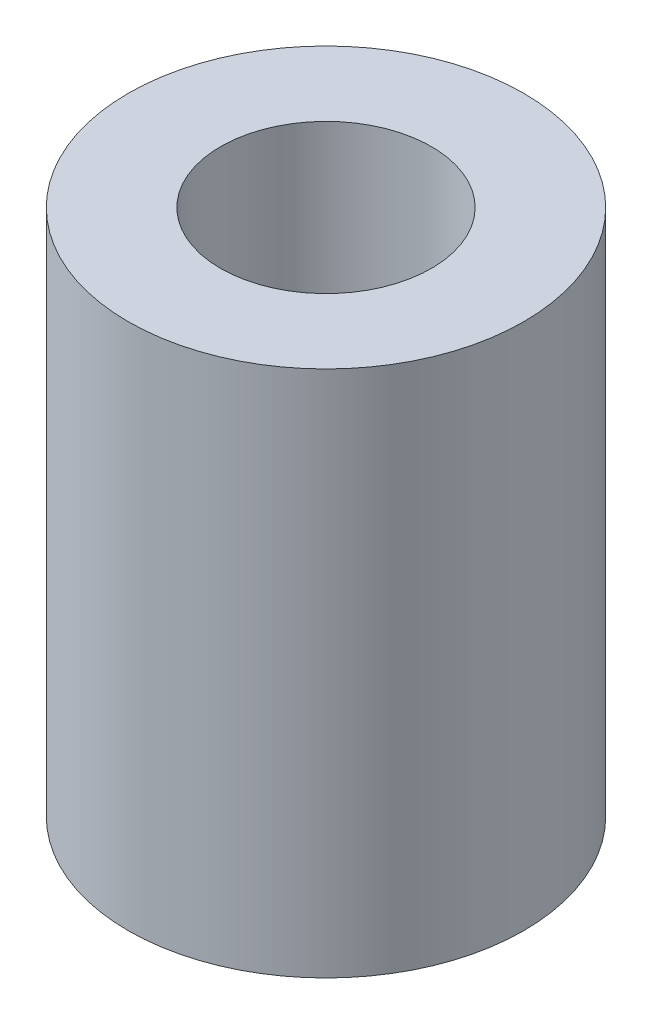
ISO-10303-21;
HEADER;
FILE_DESCRIPTION(('STEP AP214'),'2;1');
FILE_NAME('part.step','',(''),(''),'','','');
FILE_SCHEMA(('AUTOMOTIVE_DESIGN { 1 0 10303 214 1 1 1 1 }'));
ENDSEC;
DATA;
#1=APPLICATION_CONTEXT('core data for automotive mechanical design processes');
#2=APPLICATION_PROTOCOL_DEFINITION('international standard','automotive_design',2000,#1);
#3=PRODUCT_CONTEXT('',#1,'mechanical');
#4=PRODUCT('Part','Part','',(#3));
#5=PRODUCT_RELATED_PRODUCT_CATEGORY('part','',(#4));
#6=PRODUCT_DEFINITION_FORMATION('','',#4);
#7=PRODUCT_DEFINITION_CONTEXT('part definition',#1,'design');
#8=PRODUCT_DEFINITION('design','',#6,#7);
#9=PRODUCT_DEFINITION_SHAPE('','',#8);
#10=(LENGTH_UNIT() NAMED_UNIT(*) SI_UNIT(.MILLI.,.METRE.));
#11=(NAMED_UNIT(*) PLANE_ANGLE_UNIT() SI_UNIT($,.RADIAN.));
#12=(NAMED_UNIT(*) SI_UNIT($,.STERADIAN.) SOLID_ANGLE_UNIT());
#13=UNCERTAINTY_MEASURE_WITH_UNIT(LENGTH_MEASURE(1.E-05),#10,'distance_accuracy_value','');
#14=(GEOMETRIC_REPRESENTATION_CONTEXT(3) GLOBAL_UNCERTAINTY_ASSIGNED_CONTEXT((#13)) GLOBAL_UNIT_ASSIGNED_CONTEXT((#10,
#11,#12)) REPRESENTATION_CONTEXT('',''));
#15=CARTESIAN_POINT('',(0.,0.,0.));
#16=DIRECTION('',(0.,0.,1.));
#17=DIRECTION('',(1.,0.,0.));
#18=AXIS2_PLACEMENT_3D('',#15,#16,#17);
#19=CARTESIAN_POINT('',(0.,8.,0.));
#20=DIRECTION('',(0.,1.,0.));
#21=DIRECTION('',(0.,0.,1.));
#22=AXIS2_PLACEMENT_3D('',#19,#20,#21);
#23=PLANE('',#22);
#24=CARTESIAN_POINT('',(0.,8.,0.));
#25=DIRECTION('',(0.,1.,0.));
#26=DIRECTION('',(0.,0.,1.));
#27=AXIS2_PLACEMENT_3D('',#24,#25,#26);
#28=CIRCLE('',#27,3.);
#29=CARTESIAN_POINT('',(0.,8.,3.));
#30=VERTEX_POINT('',#29);
#31=EDGE_CURVE('E10',#30,#30,#28,.T.);
#32=ORIENTED_EDGE('',*,*,#31,.T.);
#33=EDGE_LOOP('',(#32));
#34=FACE_BOUND('',#33,.T.);
#35=CARTESIAN_POINT('',(0.,8.,0.));
#36=DIRECTION('',(0.,1.,0.));
#37=DIRECTION('',(0.,0.,1.));
#38=AXIS2_PLACEMENT_3D('',#35,#36,#37);
#39=CIRCLE('',#38,1.6);
#40=CARTESIAN_POINT('',(0.,8.,1.6));
#41=VERTEX_POINT('',#40);
#42=EDGE_CURVE('E44',#41,#41,#39,.T.);
#43=ORIENTED_EDGE('',*,*,#42,.F.);
#44=EDGE_LOOP('',(#43));
#45=FACE_BOUND('',#44,.T.);
#46=ADVANCED_FACE('F33',(#34,#45),#23,.T.);
#47=CARTESIAN_POINT('',(0.,0.,0.));
#48=DIRECTION('',(0.,1.,0.));
#49=DIRECTION('',(0.,0.,1.));
#50=AXIS2_PLACEMENT_3D('',#47,#48,#49);
#51=PLANE('',#50);
#52=CARTESIAN_POINT('',(0.,0.,0.));
#53=DIRECTION('',(0.,1.,0.));
#54=DIRECTION('',(0.,0.,1.));
#55=AXIS2_PLACEMENT_3D('',#52,#53,#54);
#56=CIRCLE('',#55,3.);
#57=CARTESIAN_POINT('',(0.,0.,3.));
#58=VERTEX_POINT('',#57);
#59=EDGE_CURVE('E37',#58,#58,#56,.T.);
#60=ORIENTED_EDGE('',*,*,#59,.F.);
#61=EDGE_LOOP('',(#60));
#62=FACE_BOUND('',#61,.T.);
#63=CARTESIAN_POINT('',(0.,0.,0.));
#64=DIRECTION('',(0.,1.,0.));
#65=DIRECTION('',(0.,0.,1.));
#66=AXIS2_PLACEMENT_3D('',#63,#64,#65);
#67=CIRCLE('',#66,1.6);
#68=CARTESIAN_POINT('',(0.,0.,1.6));
#69=VERTEX_POINT('',#68);
#70=EDGE_CURVE('E46',#69,#69,#67,.T.);
#71=ORIENTED_EDGE('',*,*,#70,.T.);
#72=EDGE_LOOP('',(#71));
#73=FACE_BOUND('',#72,.T.);
#74=ADVANCED_FACE('F56',(#62,#73),#51,.F.);
#75=CARTESIAN_POINT('',(0.,8.,0.));
#76=DIRECTION('',(0.,-1.,0.));
#77=DIRECTION('',(0.,0.,-1.));
#78=AXIS2_PLACEMENT_3D('',#75,#76,#77);
#79=CYLINDRICAL_SURFACE('',#78,3.);
#80=ORIENTED_EDGE('',*,*,#31,.F.);
#81=EDGE_LOOP('',(#80));
#82=FACE_BOUND('',#81,.T.);
#83=ORIENTED_EDGE('',*,*,#59,.T.);
#84=EDGE_LOOP('',(#83));
#85=FACE_BOUND('',#84,.T.);
#86=ADVANCED_FACE('F35',(#82,#85),#79,.T.);
#87=CARTESIAN_POINT('',(0.,8.,0.));
#88=DIRECTION('',(0.,-1.,0.));
#89=DIRECTION('',(0.,0.,-1.));
#90=AXIS2_PLACEMENT_3D('',#87,#88,#89);
#91=CYLINDRICAL_SURFACE('',#90,1.6);
#92=ORIENTED_EDGE('',*,*,#42,.T.);
#93=EDGE_LOOP('',(#92));
#94=FACE_BOUND('',#93,.T.);
#95=ORIENTED_EDGE('',*,*,#70,.F.);
#96=EDGE_LOOP('',(#95));
#97=FACE_BOUND('',#96,.T.);
#98=ADVANCED_FACE('F52',(#94,#97),#91,.F.);
#99=CLOSED_SHELL('',(#46,#74,#86,#98));
#100=MANIFOLD_SOLID_BREP('B2',#99);
#101=ADVANCED_BREP_SHAPE_REPRESENTATION('',(#18,#100),#14);
#102=SHAPE_DEFINITION_REPRESENTATION(#9,#101);
ENDSEC;
END-ISO-10303-21;
